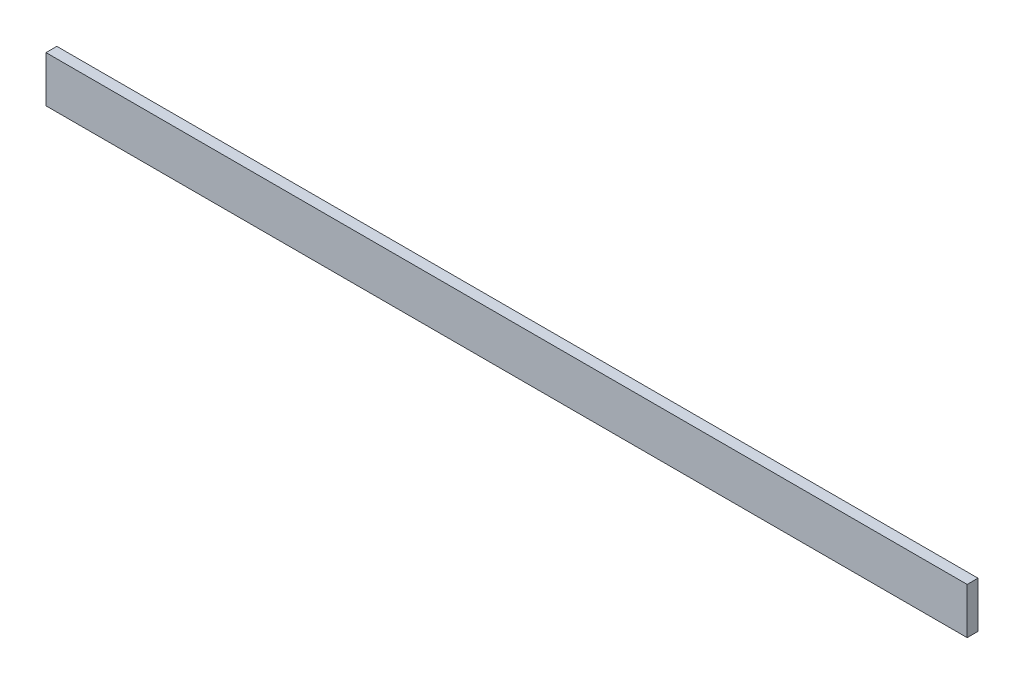
ISO-10303-21;
HEADER;
FILE_DESCRIPTION(('STEP AP214'),'2;1');
FILE_NAME('part.step','',(''),(''),'','','');
FILE_SCHEMA(('AUTOMOTIVE_DESIGN { 1 0 10303 214 1 1 1 1 }'));
ENDSEC;
DATA;
#1=APPLICATION_CONTEXT('core data for automotive mechanical design processes');
#2=APPLICATION_PROTOCOL_DEFINITION('international standard','automotive_design',2000,#1);
#3=PRODUCT_CONTEXT('',#1,'mechanical');
#4=PRODUCT('Part','Part','',(#3));
#5=PRODUCT_RELATED_PRODUCT_CATEGORY('part','',(#4));
#6=PRODUCT_DEFINITION_FORMATION('','',#4);
#7=PRODUCT_DEFINITION_CONTEXT('part definition',#1,'design');
#8=PRODUCT_DEFINITION('design','',#6,#7);
#9=PRODUCT_DEFINITION_SHAPE('','',#8);
#10=(LENGTH_UNIT() NAMED_UNIT(*) SI_UNIT(.MILLI.,.METRE.));
#11=(NAMED_UNIT(*) PLANE_ANGLE_UNIT() SI_UNIT($,.RADIAN.));
#12=(NAMED_UNIT(*) SI_UNIT($,.STERADIAN.) SOLID_ANGLE_UNIT());
#13=UNCERTAINTY_MEASURE_WITH_UNIT(LENGTH_MEASURE(1.E-05),#10,'distance_accuracy_value','');
#14=(GEOMETRIC_REPRESENTATION_CONTEXT(3) GLOBAL_UNCERTAINTY_ASSIGNED_CONTEXT((#13)) GLOBAL_UNIT_ASSIGNED_CONTEXT((#10,
#11,#12)) REPRESENTATION_CONTEXT('',''));
#15=CARTESIAN_POINT('',(0.,0.,0.));
#16=DIRECTION('',(0.,0.,1.));
#17=DIRECTION('',(1.,0.,0.));
#18=AXIS2_PLACEMENT_3D('',#15,#16,#17);
#19=CARTESIAN_POINT('',(0.,0.,11.938));
#20=DIRECTION('',(0.,1.,0.));
#21=DIRECTION('',(0.,0.,1.));
#22=AXIS2_PLACEMENT_3D('',#19,#20,#21);
#23=PLANE('',#22);
#24=DIRECTION('',(1.,0.,0.));
#25=VECTOR('',#24,1.);
#26=CARTESIAN_POINT('',(0.,0.,0.));
#27=LINE('',#26,#25);
#28=CARTESIAN_POINT('',(0.,0.,0.));
#29=VERTEX_POINT('',#28);
#30=CARTESIAN_POINT('',(1014.476,0.,0.));
#31=VERTEX_POINT('',#30);
#32=EDGE_CURVE('E96',#29,#31,#27,.T.);
#33=ORIENTED_EDGE('',*,*,#32,.T.);
#34=DIRECTION('',(0.,0.,-1.));
#35=VECTOR('',#34,1.);
#36=CARTESIAN_POINT('',(1014.476,0.,11.938));
#37=LINE('',#36,#35);
#38=CARTESIAN_POINT('',(1014.476,0.,11.938));
#39=VERTEX_POINT('',#38);
#40=EDGE_CURVE('E11',#39,#31,#37,.T.);
#41=ORIENTED_EDGE('',*,*,#40,.F.);
#42=DIRECTION('',(1.,0.,0.));
#43=VECTOR('',#42,1.);
#44=CARTESIAN_POINT('',(0.,0.,11.938));
#45=LINE('',#44,#43);
#46=CARTESIAN_POINT('',(0.,0.,11.938));
#47=VERTEX_POINT('',#46);
#48=EDGE_CURVE('E84',#47,#39,#45,.T.);
#49=ORIENTED_EDGE('',*,*,#48,.F.);
#50=DIRECTION('',(0.,0.,-1.));
#51=VECTOR('',#50,1.);
#52=CARTESIAN_POINT('',(0.,0.,11.938));
#53=LINE('',#52,#51);
#54=EDGE_CURVE('E92',#47,#29,#53,.T.);
#55=ORIENTED_EDGE('',*,*,#54,.T.);
#56=EDGE_LOOP('',(#33,#41,#49,#55));
#57=FACE_BOUND('',#56,.T.);
#58=ADVANCED_FACE('F33',(#57),#23,.F.);
#59=CARTESIAN_POINT('',(1014.476,50.8,11.938));
#60=DIRECTION('',(-1.,0.,0.));
#61=DIRECTION('',(0.,0.,1.));
#62=AXIS2_PLACEMENT_3D('',#59,#60,#61);
#63=PLANE('',#62);
#64=DIRECTION('',(0.,1.,0.));
#65=VECTOR('',#64,1.);
#66=CARTESIAN_POINT('',(1014.476,50.8,0.));
#67=LINE('',#66,#65);
#68=CARTESIAN_POINT('',(1014.476,50.8,0.));
#69=VERTEX_POINT('',#68);
#70=EDGE_CURVE('E88',#31,#69,#67,.T.);
#71=ORIENTED_EDGE('',*,*,#70,.T.);
#72=DIRECTION('',(0.,0.,-1.));
#73=VECTOR('',#72,1.);
#74=CARTESIAN_POINT('',(1014.476,50.8,11.938));
#75=LINE('',#74,#73);
#76=CARTESIAN_POINT('',(1014.476,50.8,11.938));
#77=VERTEX_POINT('',#76);
#78=EDGE_CURVE('E41',#77,#69,#75,.T.);
#79=ORIENTED_EDGE('',*,*,#78,.F.);
#80=DIRECTION('',(0.,1.,0.));
#81=VECTOR('',#80,1.);
#82=CARTESIAN_POINT('',(1014.476,50.8,11.938));
#83=LINE('',#82,#81);
#84=EDGE_CURVE('E79',#39,#77,#83,.T.);
#85=ORIENTED_EDGE('',*,*,#84,.F.);
#86=ORIENTED_EDGE('',*,*,#40,.T.);
#87=EDGE_LOOP('',(#71,#79,#85,#86));
#88=FACE_BOUND('',#87,.T.);
#89=ADVANCED_FACE('F87',(#88),#63,.F.);
#90=CARTESIAN_POINT('',(0.,50.8,11.938));
#91=DIRECTION('',(0.,-1.,0.));
#92=DIRECTION('',(0.,0.,-1.));
#93=AXIS2_PLACEMENT_3D('',#90,#91,#92);
#94=PLANE('',#93);
#95=DIRECTION('',(-1.,0.,0.));
#96=VECTOR('',#95,1.);
#97=CARTESIAN_POINT('',(0.,50.8,0.));
#98=LINE('',#97,#96);
#99=CARTESIAN_POINT('',(0.,50.8,0.));
#100=VERTEX_POINT('',#99);
#101=EDGE_CURVE('E66',#69,#100,#98,.T.);
#102=ORIENTED_EDGE('',*,*,#101,.T.);
#103=DIRECTION('',(0.,0.,-1.));
#104=VECTOR('',#103,1.);
#105=CARTESIAN_POINT('',(0.,50.8,11.938));
#106=LINE('',#105,#104);
#107=CARTESIAN_POINT('',(0.,50.8,11.938));
#108=VERTEX_POINT('',#107);
#109=EDGE_CURVE('E89',#108,#100,#106,.T.);
#110=ORIENTED_EDGE('',*,*,#109,.F.);
#111=DIRECTION('',(-1.,0.,0.));
#112=VECTOR('',#111,1.);
#113=CARTESIAN_POINT('',(0.,50.8,11.938));
#114=LINE('',#113,#112);
#115=EDGE_CURVE('E82',#77,#108,#114,.T.);
#116=ORIENTED_EDGE('',*,*,#115,.F.);
#117=ORIENTED_EDGE('',*,*,#78,.T.);
#118=EDGE_LOOP('',(#102,#110,#116,#117));
#119=FACE_BOUND('',#118,.T.);
#120=ADVANCED_FACE('F90',(#119),#94,.F.);
#121=CARTESIAN_POINT('',(0.,0.,11.938));
#122=DIRECTION('',(1.,0.,0.));
#123=DIRECTION('',(0.,0.,-1.));
#124=AXIS2_PLACEMENT_3D('',#121,#122,#123);
#125=PLANE('',#124);
#126=DIRECTION('',(0.,-1.,0.));
#127=VECTOR('',#126,1.);
#128=CARTESIAN_POINT('',(0.,0.,0.));
#129=LINE('',#128,#127);
#130=EDGE_CURVE('E72',#100,#29,#129,.T.);
#131=ORIENTED_EDGE('',*,*,#130,.T.);
#132=ORIENTED_EDGE('',*,*,#54,.F.);
#133=DIRECTION('',(0.,-1.,0.));
#134=VECTOR('',#133,1.);
#135=CARTESIAN_POINT('',(0.,0.,11.938));
#136=LINE('',#135,#134);
#137=EDGE_CURVE('E49',#108,#47,#136,.T.);
#138=ORIENTED_EDGE('',*,*,#137,.F.);
#139=ORIENTED_EDGE('',*,*,#109,.T.);
#140=EDGE_LOOP('',(#131,#132,#138,#139));
#141=FACE_BOUND('',#140,.T.);
#142=ADVANCED_FACE('F103',(#141),#125,.F.);
#143=CARTESIAN_POINT('',(0.,0.,11.938));
#144=DIRECTION('',(0.,0.,-1.));
#145=DIRECTION('',(-1.,0.,0.));
#146=AXIS2_PLACEMENT_3D('',#143,#144,#145);
#147=PLANE('',#146);
#148=ORIENTED_EDGE('',*,*,#48,.T.);
#149=ORIENTED_EDGE('',*,*,#84,.T.);
#150=ORIENTED_EDGE('',*,*,#115,.T.);
#151=ORIENTED_EDGE('',*,*,#137,.T.);
#152=EDGE_LOOP('',(#148,#149,#150,#151));
#153=FACE_BOUND('',#152,.T.);
#154=ADVANCED_FACE('F80',(#153),#147,.F.);
#155=CARTESIAN_POINT('',(0.,0.,0.));
#156=DIRECTION('',(0.,0.,-1.));
#157=DIRECTION('',(-1.,0.,0.));
#158=AXIS2_PLACEMENT_3D('',#155,#156,#157);
#159=PLANE('',#158);
#160=ORIENTED_EDGE('',*,*,#32,.F.);
#161=ORIENTED_EDGE('',*,*,#130,.F.);
#162=ORIENTED_EDGE('',*,*,#101,.F.);
#163=ORIENTED_EDGE('',*,*,#70,.F.);
#164=EDGE_LOOP('',(#160,#161,#162,#163));
#165=FACE_BOUND('',#164,.T.);
#166=ADVANCED_FACE('F106',(#165),#159,.T.);
#167=CLOSED_SHELL('',(#58,#89,#120,#142,#154,#166));
#168=MANIFOLD_SOLID_BREP('B2',#167);
#169=ADVANCED_BREP_SHAPE_REPRESENTATION('',(#18,#168),#14);
#170=SHAPE_DEFINITION_REPRESENTATION(#9,#169);
ENDSEC;
END-ISO-10303-21;
